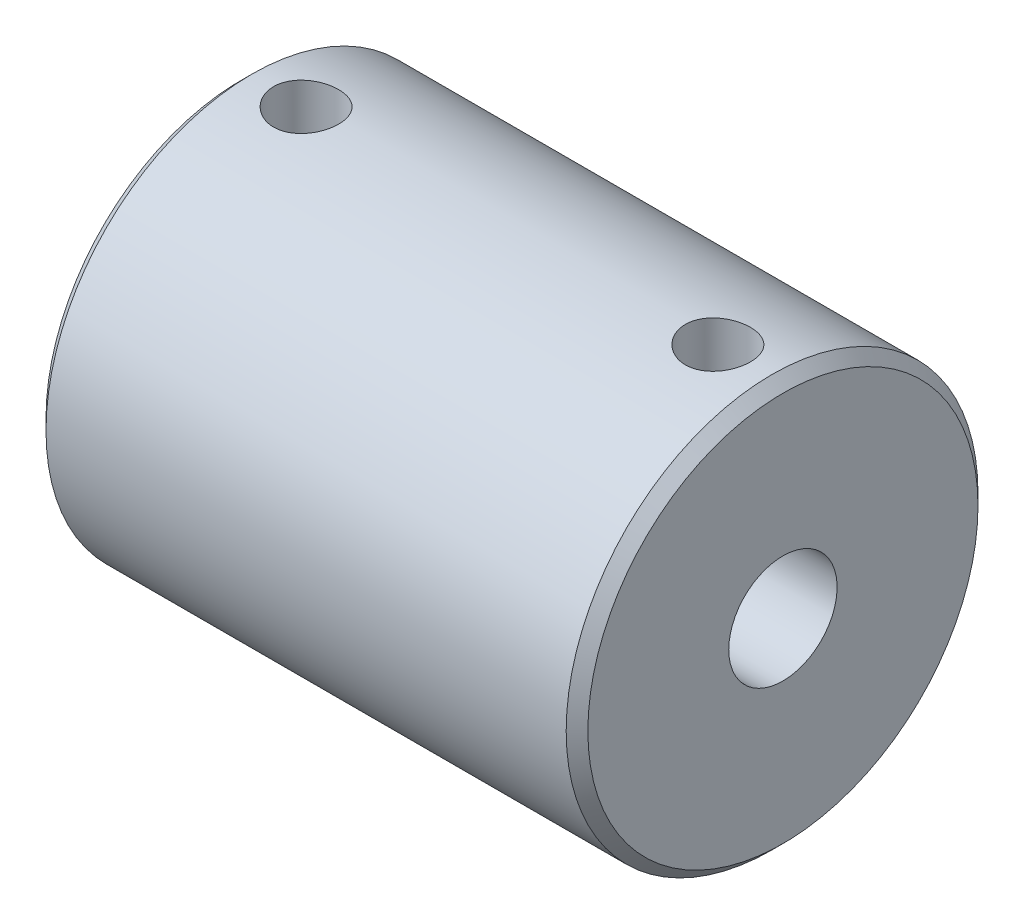
ISO-10303-21;
HEADER;
FILE_DESCRIPTION(('STEP AP214'),'2;1');
FILE_NAME('part.step','',(''),(''),'','','');
FILE_SCHEMA(('AUTOMOTIVE_DESIGN { 1 0 10303 214 1 1 1 1 }'));
ENDSEC;
DATA;
#1=APPLICATION_CONTEXT('core data for automotive mechanical design processes');
#2=APPLICATION_PROTOCOL_DEFINITION('international standard','automotive_design',2000,#1);
#3=PRODUCT_CONTEXT('',#1,'mechanical');
#4=PRODUCT('Part','Part','',(#3));
#5=PRODUCT_RELATED_PRODUCT_CATEGORY('part','',(#4));
#6=PRODUCT_DEFINITION_FORMATION('','',#4);
#7=PRODUCT_DEFINITION_CONTEXT('part definition',#1,'design');
#8=PRODUCT_DEFINITION('design','',#6,#7);
#9=PRODUCT_DEFINITION_SHAPE('','',#8);
#10=(LENGTH_UNIT() NAMED_UNIT(*) SI_UNIT(.MILLI.,.METRE.));
#11=(NAMED_UNIT(*) PLANE_ANGLE_UNIT() SI_UNIT($,.RADIAN.));
#12=(NAMED_UNIT(*) SI_UNIT($,.STERADIAN.) SOLID_ANGLE_UNIT());
#13=UNCERTAINTY_MEASURE_WITH_UNIT(LENGTH_MEASURE(1.E-05),#10,'distance_accuracy_value','');
#14=(GEOMETRIC_REPRESENTATION_CONTEXT(3) GLOBAL_UNCERTAINTY_ASSIGNED_CONTEXT((#13)) GLOBAL_UNIT_ASSIGNED_CONTEXT((#10,
#11,#12)) REPRESENTATION_CONTEXT('',''));
#15=CARTESIAN_POINT('',(0.,0.,0.));
#16=DIRECTION('',(0.,0.,1.));
#17=DIRECTION('',(1.,0.,0.));
#18=AXIS2_PLACEMENT_3D('',#15,#16,#17);
#19=CARTESIAN_POINT('',(-12.5000000000002,0.,0.));
#20=DIRECTION('',(-1.,0.,0.));
#21=DIRECTION('',(0.,0.,1.));
#22=AXIS2_PLACEMENT_3D('',#19,#20,#21);
#23=CYLINDRICAL_SURFACE('',#22,3.99999999999978);
#24=CARTESIAN_POINT('',(-4.44089209850063E-13,0.,0.));
#25=DIRECTION('',(-1.,0.,0.));
#26=DIRECTION('',(0.,0.,1.));
#27=AXIS2_PLACEMENT_3D('',#24,#25,#26);
#28=CIRCLE('',#27,3.99999999999978);
#29=CARTESIAN_POINT('',(-4.44089209850063E-13,0.,3.99999999999978));
#30=VERTEX_POINT('',#29);
#31=EDGE_CURVE('E52',#30,#30,#28,.T.);
#32=ORIENTED_EDGE('',*,*,#31,.F.);
#33=EDGE_LOOP('',(#32));
#34=FACE_BOUND('',#33,.T.);
#35=CARTESIAN_POINT('',(-12.5000000000002,0.,0.));
#36=DIRECTION('',(-1.,0.,0.));
#37=DIRECTION('',(0.,0.,1.));
#38=AXIS2_PLACEMENT_3D('',#35,#36,#37);
#39=CIRCLE('',#38,3.99999999999978);
#40=CARTESIAN_POINT('',(-12.5000000000002,0.,3.99999999999978));
#41=VERTEX_POINT('',#40);
#42=EDGE_CURVE('E61',#41,#41,#39,.T.);
#43=ORIENTED_EDGE('',*,*,#42,.T.);
#44=EDGE_LOOP('',(#43));
#45=FACE_BOUND('',#44,.T.);
#46=CARTESIAN_POINT('',(-9.50000000000073,3.70809924354753,-1.50000000000017));
#47=CARTESIAN_POINT('',(-9.58100748372152,3.70809640633776,-1.50000304106126));
#48=CARTESIAN_POINT('',(-9.66199492250437,3.71078260240956,-1.49341597549504));
#49=CARTESIAN_POINT('',(-9.82152808291394,3.72116159304937,-1.46736187895485));
#50=CARTESIAN_POINT('',(-9.90007387759575,3.72885423767082,-1.4478952337328));
#51=CARTESIAN_POINT('',(-10.0523753716143,3.74825480280871,-1.39689657610591));
#52=CARTESIAN_POINT('',(-10.1261420566518,3.75995309569231,-1.36539347266365));
#53=CARTESIAN_POINT('',(-10.2673718968196,3.7860313420657,-1.29131856742714));
#54=CARTESIAN_POINT('',(-10.3348331502833,3.80041210067295,-1.24874344095055));
#55=CARTESIAN_POINT('',(-10.4648903116236,3.83103574665685,-1.15146661374179));
#56=CARTESIAN_POINT('',(-10.5271285296301,3.84733341923576,-1.09630381213323));
#57=CARTESIAN_POINT('',(-10.6417228146722,3.8794975062852,-0.97639583977909));
#58=CARTESIAN_POINT('',(-10.6940767737426,3.89536382814759,-0.911648630256843));
#59=CARTESIAN_POINT('',(-10.7891395122964,3.92552873936528,-0.77169465517776));
#60=CARTESIAN_POINT('',(-10.8314594747166,3.9397556122348,-0.696206947538185));
#61=CARTESIAN_POINT('',(-10.9026511725257,3.96438007973823,-0.538555771965397));
#62=CARTESIAN_POINT('',(-10.9315275719928,3.97477900216983,-0.456394630933682));
#63=CARTESIAN_POINT('',(-10.9737578957754,3.99018697103417,-0.291489341676971));
#64=CARTESIAN_POINT('',(-10.9877276274412,3.99540915214752,-0.208923197281731));
#65=CARTESIAN_POINT('',(-11.0017212009458,4.00064014107918,-0.0424643637949135));
#66=CARTESIAN_POINT('',(-11.0017495776195,4.0006506441488,0.0414278850627095));
#67=CARTESIAN_POINT('',(-10.9882182385356,3.99559265903873,0.203743543064359));
#68=CARTESIAN_POINT('',(-10.975330702052,3.99077541996662,0.282232178266786));
#69=CARTESIAN_POINT('',(-10.9374640847752,3.97693274932242,0.435839217984282));
#70=CARTESIAN_POINT('',(-10.9124841477388,3.96790701975557,0.510957383430192));
#71=CARTESIAN_POINT('',(-10.8508295483249,3.9463776916751,0.656989017303002));
#72=CARTESIAN_POINT('',(-10.8139899947324,3.93382539470057,0.727825392287209));
#73=CARTESIAN_POINT('',(-10.7298079030714,3.90651310225259,0.862486607957464));
#74=CARTESIAN_POINT('',(-10.6824619769832,3.8917523951282,0.92630917693223));
#75=CARTESIAN_POINT('',(-10.5753727137176,3.86052529655796,1.04909048680085));
#76=CARTESIAN_POINT('',(-10.5150660843504,3.84400963763862,1.1075461452634));
#77=CARTESIAN_POINT('',(-10.3854070066792,3.81182460645702,1.21370395569334));
#78=CARTESIAN_POINT('',(-10.3160522934141,3.79615544748827,1.26140340692892));
#79=CARTESIAN_POINT('',(-10.168280532538,3.76712703500315,1.34565611808144));
#80=CARTESIAN_POINT('',(-10.0896965063147,3.75382677150256,1.38193847851824));
#81=CARTESIAN_POINT('',(-9.9269037748332,3.73172438628982,1.44056464441495));
#82=CARTESIAN_POINT('',(-9.84269822840708,3.72291976205762,1.46291620605589));
#83=CARTESIAN_POINT('',(-9.67602403768481,3.71139597222827,1.49190191709662));
#84=CARTESIAN_POINT('',(-9.59371589446462,3.70836785241516,1.4993352115896));
#85=CARTESIAN_POINT('',(-9.42899064325901,3.70786539524994,1.50057885636267));
#86=CARTESIAN_POINT('',(-9.34657356764828,3.71038967003965,1.49439261093757));
#87=CARTESIAN_POINT('',(-9.18807007771306,3.72039381629714,1.46929733520152));
#88=CARTESIAN_POINT('',(-9.11186886423608,3.72763276216427,1.4510061833422));
#89=CARTESIAN_POINT('',(-8.96365205528054,3.7459648704634,1.40299774640633));
#90=CARTESIAN_POINT('',(-8.8916373208326,3.75705882250151,1.37327812034618));
#91=CARTESIAN_POINT('',(-8.75083556192452,3.78236243116058,1.30200292275273));
#92=CARTESIAN_POINT('',(-8.68227070786338,3.79667328892044,1.26004545177042));
#93=CARTESIAN_POINT('',(-8.55287101827468,3.8266281429427,1.16591317862474));
#94=CARTESIAN_POINT('',(-8.49203902537608,3.84227262594056,1.1137346369643));
#95=CARTESIAN_POINT('',(-8.37583162680561,3.87433046553163,0.996727340900885));
#96=CARTESIAN_POINT('',(-8.32104659123195,3.89072969357006,0.931306341491007));
#97=CARTESIAN_POINT('',(-8.22316163241126,3.92149874963281,0.791797471753093));
#98=CARTESIAN_POINT('',(-8.18006174705485,3.93586857107643,0.717709573322613));
#99=CARTESIAN_POINT('',(-8.10705394380108,3.96094985704531,0.563016329468413));
#100=CARTESIAN_POINT('',(-8.07710087620808,3.97167381337989,0.48243443306456));
#101=CARTESIAN_POINT('',(-8.03134358615076,3.9882943671255,0.316881887523183));
#102=CARTESIAN_POINT('',(-8.01553271457828,3.99419323299391,0.231913320723519));
#103=CARTESIAN_POINT('',(-7.99922559724585,4.00028407317051,0.0653355852737363));
#104=CARTESIAN_POINT('',(-7.99789051694168,4.00078860953742,-0.0161807680609268));
#105=CARTESIAN_POINT('',(-8.00841515944606,3.99684889809201,-0.17822678641251));
#106=CARTESIAN_POINT('',(-8.02027329088653,3.99240524713108,-0.258756569245345));
#107=CARTESIAN_POINT('',(-8.05625885149429,3.97921089603748,-0.414548248377219));
#108=CARTESIAN_POINT('',(-8.08007990587902,3.97056791377994,-0.48989073106893));
#109=CARTESIAN_POINT('',(-8.13901001338502,3.94987783620966,-0.63551547300649));
#110=CARTESIAN_POINT('',(-8.17412120330541,3.9378300965564,-0.705796771275645));
#111=CARTESIAN_POINT('',(-8.25631394350547,3.9109061830005,-0.842540176994521));
#112=CARTESIAN_POINT('',(-8.30383664051481,3.89593240108803,-0.908717548846961));
#113=CARTESIAN_POINT('',(-8.40880783018826,3.86499507694818,-1.03241734752348));
#114=CARTESIAN_POINT('',(-8.46625986580854,3.84903118274001,-1.08993667125602));
#115=CARTESIAN_POINT('',(-8.59306413164572,3.81688129739148,-1.19781214236209));
#116=CARTESIAN_POINT('',(-8.66288440215497,3.80072805349132,-1.24762999816039));
#117=CARTESIAN_POINT('',(-8.81041586957399,3.7709832500361,-1.33484709556857));
#118=CARTESIAN_POINT('',(-8.88812788405415,3.75739195631188,-1.37224504878171));
#119=CARTESIAN_POINT('',(-9.05295568097609,3.73402269853237,-1.43465886974276));
#120=CARTESIAN_POINT('',(-9.14033436651247,3.7244380329083,-1.45906002899539));
#121=CARTESIAN_POINT('',(-9.3184852719565,3.71147994336285,-1.49172356722096));
#122=CARTESIAN_POINT('',(-9.40925521271071,3.70810242179706,-1.49999659339587));
#123=CARTESIAN_POINT('',(-9.50000000000073,3.70809924354753,-1.50000000000017));
#124=B_SPLINE_CURVE_WITH_KNOTS('',3,(#46,#47,#48,#49,#50,#51,#52,#53,#54,#55,#56,#57,#58,#59,
#60,#61,#62,#63,#64,#65,#66,#67,#68,#69,#70,#71,#72,#73,#74,#75,#76,#77,#78,#79,#80,#81,#82,#83,
#84,#85,#86,#87,#88,#89,#90,#91,#92,#93,#94,#95,#96,#97,#98,#99,#100,#101,#102,#103,#104,#105,
#106,#107,#108,#109,#110,#111,#112,#113,#114,#115,#116,#117,#118,#119,#120,#121,#122,#123),
.UNSPECIFIED.,.T.,.F.,(4,2,2,2,2,2,2,2,2,2,2,2,2,2,2,2,2,2,2,2,2,2,2,2,2,2,2,2,2,2,2,2,2,2,2,2,
2,2,4),(0.,0.242684541416176,0.485361814598865,0.727459856757045,0.969630679682955,
1.22274652401131,1.47591628822987,1.73770072136426,1.99939426381337,2.24980018489687,
2.50012465404866,2.73806472803204,2.97602165263346,3.21744131210679,3.45893893628987,
3.71456675065887,3.97025867827348,4.23162592252981,4.49284751635489,4.73965657740501,
4.98640395388902,5.22143845928217,5.45652113429545,5.70041561005841,5.94439948466376,
6.20385016993646,6.463301696502,6.72185508890192,6.98028685560151,7.22365720549961,
7.46699820319505,7.70440274003917,7.94185223512858,8.18928323677015,8.43680270894993,
8.69738599542109,8.95799630544274,9.23003178870961,9.50188762323091),.UNSPECIFIED.);
#125=CARTESIAN_POINT('',(-9.50000000000073,3.70809924354753,-1.50000000000017));
#126=VERTEX_POINT('',#125);
#127=EDGE_CURVE('E98',#126,#126,#124,.T.);
#128=ORIENTED_EDGE('',*,*,#127,.T.);
#129=EDGE_LOOP('',(#128));
#130=FACE_BOUND('',#129,.T.);
#131=ADVANCED_FACE('F32',(#34,#45,#130),#23,.F.);
#132=CARTESIAN_POINT('',(-12.5000000000002,0.,0.));
#133=DIRECTION('',(-1.,0.,0.));
#134=DIRECTION('',(0.,0.,1.));
#135=AXIS2_PLACEMENT_3D('',#132,#133,#134);
#136=CYLINDRICAL_SURFACE('',#135,2.49999999999984);
#137=CARTESIAN_POINT('',(12.4999999999997,0.,0.));
#138=DIRECTION('',(-1.,0.,0.));
#139=DIRECTION('',(0.,0.,1.));
#140=AXIS2_PLACEMENT_3D('',#137,#138,#139);
#141=CIRCLE('',#140,2.49999999999984);
#142=CARTESIAN_POINT('',(12.4999999999997,0.,2.49999999999984));
#143=VERTEX_POINT('',#142);
#144=EDGE_CURVE('E58',#143,#143,#141,.T.);
#145=ORIENTED_EDGE('',*,*,#144,.F.);
#146=EDGE_LOOP('',(#145));
#147=FACE_BOUND('',#146,.T.);
#148=CARTESIAN_POINT('',(-4.44089209850063E-13,0.,0.));
#149=DIRECTION('',(-1.,0.,0.));
#150=DIRECTION('',(0.,0.,1.));
#151=AXIS2_PLACEMENT_3D('',#148,#149,#150);
#152=CIRCLE('',#151,2.49999999999984);
#153=CARTESIAN_POINT('',(-4.44089209850063E-13,0.,2.49999999999984));
#154=VERTEX_POINT('',#153);
#155=EDGE_CURVE('E55',#154,#154,#152,.T.);
#156=ORIENTED_EDGE('',*,*,#155,.T.);
#157=EDGE_LOOP('',(#156));
#158=FACE_BOUND('',#157,.T.);
#159=CARTESIAN_POINT('',(9.49999999999918,1.99999999999984,-1.49999999999995));
#160=CARTESIAN_POINT('',(9.42452102470954,1.99999416642495,-1.50000404108586));
#161=CARTESIAN_POINT('',(9.34906156591938,2.00433633903465,-1.49426852824008));
#162=CARTESIAN_POINT('',(9.20067609603695,2.02092590613866,-1.47174965152782));
#163=CARTESIAN_POINT('',(9.12775281261407,2.03318155043081,-1.4549547578893));
#164=CARTESIAN_POINT('',(8.98691635832188,2.06362339034714,-1.4114348633579));
#165=CARTESIAN_POINT('',(8.91897116196389,2.08176666183104,-1.38478154503144));
#166=CARTESIAN_POINT('',(8.78856254663123,2.1218590499582,-1.32252909283013));
#167=CARTESIAN_POINT('',(8.72610077030401,2.143809301224,-1.28692729054687));
#168=CARTESIAN_POINT('',(8.60005098333506,2.19228594587527,-1.20271292747638));
#169=CARTESIAN_POINT('',(8.5372590428752,2.21904371037647,-1.15304179435282));
#170=CARTESIAN_POINT('',(8.42023523725739,2.27226229431046,-1.04426801309978));
#171=CARTESIAN_POINT('',(8.36600984832834,2.29872287517088,-0.985158296729543));
#172=CARTESIAN_POINT('',(8.26186619028944,2.35175567858719,-0.851442367411626));
#173=CARTESIAN_POINT('',(8.21304553632938,2.37803133577803,-0.77585199516247));
#174=CARTESIAN_POINT('',(8.12919027755469,2.42443786983164,-0.615654228271574));
#175=CARTESIAN_POINT('',(8.09414302587641,2.4445743798872,-0.531055196626242));
#176=CARTESIAN_POINT('',(8.04240407718647,2.47470987800425,-0.363771406742572));
#177=CARTESIAN_POINT('',(8.02427963903182,2.48549303939154,-0.281674698130819));
#178=CARTESIAN_POINT('',(8.002057197136,2.49874939277529,-0.11497050938261));
#179=CARTESIAN_POINT('',(7.99794602199907,2.50123038813291,-0.0303654624000535));
#180=CARTESIAN_POINT('',(8.00361374734158,2.49783372711522,0.127637283737411));
#181=CARTESIAN_POINT('',(8.01173352616843,2.49295437513709,0.201123832865737));
#182=CARTESIAN_POINT('',(8.03847979564722,2.47707997553839,0.34546426915187));
#183=CARTESIAN_POINT('',(8.05710706390627,2.4660844752929,0.416317961051304));
#184=CARTESIAN_POINT('',(8.10416556270289,2.438849072017,0.554056780469183));
#185=CARTESIAN_POINT('',(8.13265306113811,2.42257910450804,0.620916491037723));
#186=CARTESIAN_POINT('',(8.19838461622465,2.38609637638728,0.748988660115719));
#187=CARTESIAN_POINT('',(8.23563094705812,2.36588259201791,0.810199646208119));
#188=CARTESIAN_POINT('',(8.32283909280356,2.3203792597634,0.933074267143312));
#189=CARTESIAN_POINT('',(8.37378831173484,2.29477182952127,0.993918663198309));
#190=CARTESIAN_POINT('',(8.48440411785928,2.24255554245577,1.10671465909287));
#191=CARTESIAN_POINT('',(8.54408250347361,2.2159453670335,1.15865401308352));
#192=CARTESIAN_POINT('',(8.67865340616266,2.16111075123919,1.2582483776743));
#193=CARTESIAN_POINT('',(8.75450757653857,2.13305661385097,1.30470933188646));
#194=CARTESIAN_POINT('',(8.91470623163572,2.08250879557238,1.38397217194247));
#195=CARTESIAN_POINT('',(8.99903471612476,2.0600049029879,1.41679921962204));
#196=CARTESIAN_POINT('',(9.15239363189447,2.028958651967,1.46077497064858));
#197=CARTESIAN_POINT('',(9.22004063229576,2.01833888618284,1.47527903312681));
#198=CARTESIAN_POINT('',(9.35737361029859,2.00392150777525,1.494808727553));
#199=CARTESIAN_POINT('',(9.42705712048367,2.00011596115083,1.49984538302923));
#200=CARTESIAN_POINT('',(9.5665516824348,1.9998891432129,1.500147811142));
#201=CARTESIAN_POINT('',(9.6363627772143,2.00347810223951,1.49540004697676));
#202=CARTESIAN_POINT('',(9.77398734374765,2.01751520788618,1.4764029057496));
#203=CARTESIAN_POINT('',(9.84179919223934,2.02796877613179,1.46214601830158));
#204=CARTESIAN_POINT('',(9.97371457947887,2.05431768333066,1.42488312618677));
#205=CARTESIAN_POINT('',(10.0378226365313,2.07020622092778,1.40188805257383));
#206=CARTESIAN_POINT('',(10.1614777157293,2.10571539417553,1.34796261057095));
#207=CARTESIAN_POINT('',(10.2210230063651,2.12533743689965,1.31702924888235));
#208=CARTESIAN_POINT('',(10.3452400825113,2.17036819177703,1.24167439558537));
#209=CARTESIAN_POINT('',(10.4089008350956,2.19618239397336,1.19582663060328));
#210=CARTESIAN_POINT('',(10.5282854848485,2.24821754803589,1.09487395518728));
#211=CARTESIAN_POINT('',(10.5840016921682,2.27443886711424,1.03976018672431));
#212=CARTESIAN_POINT('',(10.6932240073495,2.32835625910884,0.913274837213068));
#213=CARTESIAN_POINT('',(10.745500726605,2.35580075875842,0.840721108780496));
#214=CARTESIAN_POINT('',(10.8369027768358,2.40537639133433,0.686103100868329));
#215=CARTESIAN_POINT('',(10.8760368278401,2.42751104449386,0.604045176135012));
#216=CARTESIAN_POINT('',(10.9368682034305,2.46252280092753,0.438840232972443));
#217=CARTESIAN_POINT('',(10.9596262277903,2.47595588067308,0.356205963651558));
#218=CARTESIAN_POINT('',(10.9907146028455,2.49440738906081,0.187383063891142));
#219=CARTESIAN_POINT('',(10.9990612907168,2.4994353458272,0.101198571782245));
#220=CARTESIAN_POINT('',(11.0006746085852,2.5004060046196,-0.0598120232007227));
#221=CARTESIAN_POINT('',(10.9958033345623,2.49747057186312,-0.13462058358945));
#222=CARTESIAN_POINT('',(10.9751061756176,2.48512948412082,-0.28214875597853));
#223=CARTESIAN_POINT('',(10.9592801686777,2.47572375706626,-0.354868344701677));
#224=CARTESIAN_POINT('',(10.9177804284155,2.4514942752695,-0.495145481978568));
#225=CARTESIAN_POINT('',(10.89226840387,2.43675966858895,-0.562767032608604));
#226=CARTESIAN_POINT('',(10.8323594054445,2.40303337447144,-0.692781971999765));
#227=CARTESIAN_POINT('',(10.7979604391397,2.38404073252258,-0.755174184199616));
#228=CARTESIAN_POINT('',(10.7170748034306,2.34093432659371,-0.880263645295737));
#229=CARTESIAN_POINT('',(10.6696812909825,2.3164884463914,-0.942258690439733));
#230=CARTESIAN_POINT('',(10.5662469662816,2.26601907350652,-1.05789751536287));
#231=CARTESIAN_POINT('',(10.5101965743914,2.239993852745,-1.11153190956896));
#232=CARTESIAN_POINT('',(10.3827144378217,2.18528165666196,-1.21590975350552));
#233=CARTESIAN_POINT('',(10.3102335138339,2.15667566270892,-1.26542406663351));
#234=CARTESIAN_POINT('',(10.1565151472328,2.10376464485135,-1.3515681721031));
#235=CARTESIAN_POINT('',(10.075282286018,2.07945738811042,-1.38820466322647));
#236=CARTESIAN_POINT('',(9.91293571486216,2.04080003047947,-1.44437116535122));
#237=CARTESIAN_POINT('',(9.83240476403808,2.02577665830124,-1.46509526060179));
#238=CARTESIAN_POINT('',(9.66790260529558,2.0053903232002,-1.4928926824042));
#239=CARTESIAN_POINT('',(9.5839392342405,2.00000648744627,-1.49999550595831));
#240=CARTESIAN_POINT('',(9.49999999999918,1.99999999999984,-1.49999999999995));
#241=B_SPLINE_CURVE_WITH_KNOTS('',3,(#159,#160,#161,#162,#163,#164,#165,#166,#167,#168,#169,
#170,#171,#172,#173,#174,#175,#176,#177,#178,#179,#180,#181,#182,#183,#184,#185,#186,#187,#188,
#189,#190,#191,#192,#193,#194,#195,#196,#197,#198,#199,#200,#201,#202,#203,#204,#205,#206,#207,
#208,#209,#210,#211,#212,#213,#214,#215,#216,#217,#218,#219,#220,#221,#222,#223,#224,#225,#226,
#227,#228,#229,#230,#231,#232,#233,#234,#235,#236,#237,#238,#239,#240),.UNSPECIFIED.,.T.,.F.,(4,
2,2,2,2,2,2,2,2,2,2,2,2,2,2,2,2,2,2,2,2,2,2,2,2,2,2,2,2,2,2,2,2,2,2,2,2,2,2,2,4),(0.,
0.226085249493399,0.452406574330785,0.677113624991901,0.901887762215962,1.15414462390005,
1.40659128601849,1.68630157736229,1.96575443271227,2.21853330858505,2.47107452602774,
2.6923013054319,2.91354445887953,3.13607155036385,3.35865648368887,3.60782810055859,
3.8573396665692,4.1357667114029,4.41367760154784,4.62276298054698,4.8316047564399,
5.04073566011194,5.2500319330414,5.45906724365506,5.6681814915467,5.91499438482011,
6.16204457978462,6.44121828011599,6.7202063838486,6.97891479383353,7.23732973022745,
7.46129321849419,7.68525920139669,7.90563970188777,8.12606965394605,8.37042963549506,
8.61506198741973,8.89071695766622,9.16622832484824,9.41820120134384,9.6696278091232),.UNSPECIFIED.);
#242=CARTESIAN_POINT('',(9.49999999999918,1.99999999999984,-1.49999999999995));
#243=VERTEX_POINT('',#242);
#244=EDGE_CURVE('E65',#243,#243,#241,.T.);
#245=ORIENTED_EDGE('',*,*,#244,.T.);
#246=EDGE_LOOP('',(#245));
#247=FACE_BOUND('',#246,.T.);
#248=ADVANCED_FACE('F115',(#147,#158,#247),#136,.F.);
#249=CARTESIAN_POINT('',(-12.5000000000002,0.,0.));
#250=DIRECTION('',(-1.,0.,0.));
#251=DIRECTION('',(0.,0.,1.));
#252=AXIS2_PLACEMENT_3D('',#249,#250,#251);
#253=CYLINDRICAL_SURFACE('',#252,9.49999999999984);
#254=CARTESIAN_POINT('',(-12.0000000000002,0.,0.));
#255=DIRECTION('',(1.,0.,0.));
#256=DIRECTION('',(0.,0.,-1.));
#257=AXIS2_PLACEMENT_3D('',#254,#255,#256);
#258=CIRCLE('',#257,9.49999999999984);
#259=CARTESIAN_POINT('',(-12.0000000000002,0.,-9.49999999999984));
#260=VERTEX_POINT('',#259);
#261=EDGE_CURVE('E39',#260,#260,#258,.T.);
#262=ORIENTED_EDGE('',*,*,#261,.T.);
#263=EDGE_LOOP('',(#262));
#264=FACE_BOUND('',#263,.T.);
#265=CARTESIAN_POINT('',(11.9999999999997,0.,0.));
#266=DIRECTION('',(1.,0.,0.));
#267=DIRECTION('',(0.,0.,-1.));
#268=AXIS2_PLACEMENT_3D('',#265,#266,#267);
#269=CIRCLE('',#268,9.49999999999984);
#270=CARTESIAN_POINT('',(11.9999999999997,0.,-9.49999999999984));
#271=VERTEX_POINT('',#270);
#272=EDGE_CURVE('E43',#271,#271,#269,.F.);
#273=ORIENTED_EDGE('',*,*,#272,.T.);
#274=EDGE_LOOP('',(#273));
#275=FACE_BOUND('',#274,.T.);
#276=CARTESIAN_POINT('',(9.49999999999918,9.38083151964671,-1.49999999999995));
#277=CARTESIAN_POINT('',(9.41630973099314,9.38083297404052,-1.4999965845505));
#278=CARTESIAN_POINT('',(9.3325722057596,9.38196360092013,-1.49297223784078));
#279=CARTESIAN_POINT('',(9.16744219630623,9.38636039550326,-1.46507009131932));
#280=CARTESIAN_POINT('',(9.08605201876941,9.38962859377928,-1.44417911871306));
#281=CARTESIAN_POINT('',(8.92803062681439,9.39792135372617,-1.38918760267273));
#282=CARTESIAN_POINT('',(8.85139566713777,9.40294451195268,-1.3550976121646));
#283=CARTESIAN_POINT('',(8.70494308976362,9.41417954535185,-1.27470128030852));
#284=CARTESIAN_POINT('',(8.63512461427251,9.42039127066202,-1.22839647880726));
#285=CARTESIAN_POINT('',(8.5036587559119,9.4333650383851,-1.1244471383638));
#286=CARTESIAN_POINT('',(8.44208051568565,9.44013105201456,-1.06671563821391));
#287=CARTESIAN_POINT('',(8.32944292542648,9.45341567106024,-0.941739545888648));
#288=CARTESIAN_POINT('',(8.27838417422193,9.45993426237456,-0.874494412511199));
#289=CARTESIAN_POINT('',(8.18797774403456,9.47203134599654,-0.731954548292079));
#290=CARTESIAN_POINT('',(8.14869405700653,9.47760463238802,-0.656618750818272));
#291=CARTESIAN_POINT('',(8.08336383437381,9.48713906529752,-0.500315336961878));
#292=CARTESIAN_POINT('',(8.05731652523227,9.49110030602114,-0.419348049999248));
#293=CARTESIAN_POINT('',(8.01940893218588,9.4969362980598,-0.254793214503829));
#294=CARTESIAN_POINT('',(8.00743267318298,9.49882809687214,-0.171232996932396));
#295=CARTESIAN_POINT('',(7.9976467905339,9.50037054461914,-0.00326909893878029));
#296=CARTESIAN_POINT('',(7.99983629844012,9.50002133094149,0.0811345294604442));
#297=CARTESIAN_POINT('',(8.01822877181978,9.49713466336602,0.247597304848761));
#298=CARTESIAN_POINT('',(8.0343069477585,9.4946166962783,0.329670625894022));
#299=CARTESIAN_POINT('',(8.07982419166969,9.48769715323501,0.489939598315428));
#300=CARTESIAN_POINT('',(8.1092636331835,9.48329552461806,0.568135141212597));
#301=CARTESIAN_POINT('',(8.18079375615204,9.47306987014868,0.718803540216258));
#302=CARTESIAN_POINT('',(8.22293645712464,9.4672400144859,0.791251288178998));
#303=CARTESIAN_POINT('',(8.31863878352587,9.4548067115046,0.92809384959411));
#304=CARTESIAN_POINT('',(8.3721992402151,9.44820320787701,0.992488076174384));
#305=CARTESIAN_POINT('',(8.48991047611315,9.43487320037029,1.11213206749245));
#306=CARTESIAN_POINT('',(8.55417026276891,9.42814614020964,1.1672745780543));
#307=CARTESIAN_POINT('',(8.69108712416624,9.41539709463324,1.26601092962915));
#308=CARTESIAN_POINT('',(8.76374426178539,9.40937511449767,1.30960468415951));
#309=CARTESIAN_POINT('',(8.91551094643623,9.39871800561204,1.38402357522732));
#310=CARTESIAN_POINT('',(8.99462642215803,9.39408416980411,1.41483681797806));
#311=CARTESIAN_POINT('',(9.15699942058984,9.38675017598379,1.4627074978431));
#312=CARTESIAN_POINT('',(9.24025661752225,9.3840498661414,1.47976601505963));
#313=CARTESIAN_POINT('',(9.40759295565802,9.38091773533541,1.4994941104296));
#314=CARTESIAN_POINT('',(9.49165369121741,9.38046188392356,1.5023161208022));
#315=CARTESIAN_POINT('',(9.65904705893222,9.38180638869053,1.49389636898127));
#316=CARTESIAN_POINT('',(9.74237971611599,9.38360666700312,1.48265509215656));
#317=CARTESIAN_POINT('',(9.90547366936188,9.3892384519747,1.44655746438424));
#318=CARTESIAN_POINT('',(9.98525237171265,9.3930585117587,1.42177781446749));
#319=CARTESIAN_POINT('',(10.1395243407153,9.40228991972521,1.35938693205207));
#320=CARTESIAN_POINT('',(10.2140173203886,9.40770135422655,1.32177500349146));
#321=CARTESIAN_POINT('',(10.3562843153162,9.41956203589055,1.23442398163641));
#322=CARTESIAN_POINT('',(10.4239973256046,9.42601953670201,1.1845866710986));
#323=CARTESIAN_POINT('',(10.5501534885918,9.43922022959424,1.07433532022979));
#324=CARTESIAN_POINT('',(10.6085960580292,9.44596343961696,1.0139206149114));
#325=CARTESIAN_POINT('',(10.7151040379325,9.45905128553875,0.883556250112928));
#326=CARTESIAN_POINT('',(10.7630681337625,9.46539164279532,0.813523322568075));
#327=CARTESIAN_POINT('',(10.8465500312286,9.47689193046165,0.666305394879959));
#328=CARTESIAN_POINT('',(10.8820682027036,9.48205189594596,0.589120607345147));
#329=CARTESIAN_POINT('',(10.9394900801753,9.4905913350519,0.430099180755925));
#330=CARTESIAN_POINT('',(10.9614480818947,9.49397790107181,0.348282544696238));
#331=CARTESIAN_POINT('',(10.9913016379697,9.49861883842432,0.182065541000644));
#332=CARTESIAN_POINT('',(10.9991982260063,9.49987336648676,0.0976653637497523));
#333=CARTESIAN_POINT('',(11.0006774861186,9.50010700904766,-0.0703424890560549));
#334=CARTESIAN_POINT('',(10.9944147738008,9.49911070212576,-0.153948809855574));
#335=CARTESIAN_POINT('',(10.9680860098252,9.49500446266288,-0.318903288593668));
#336=CARTESIAN_POINT('',(10.9480200169141,9.49189453911744,-0.400251456141409));
#337=CARTESIAN_POINT('',(10.89471123864,9.48390902705514,-0.558330315524323));
#338=CARTESIAN_POINT('',(10.8614802910497,9.47903502511613,-0.635065084473709));
#339=CARTESIAN_POINT('',(10.7828017130734,9.46805518209944,-0.781893871437035));
#340=CARTESIAN_POINT('',(10.7373536008617,9.46194929244043,-0.851987627392393));
#341=CARTESIAN_POINT('',(10.6349767236377,9.44910438099909,-0.9843264992901));
#342=CARTESIAN_POINT('',(10.5779342156674,9.44235947063336,-1.04648306132945));
#343=CARTESIAN_POINT('',(10.4542269669346,9.42903896923972,-1.16039729972457));
#344=CARTESIAN_POINT('',(10.3875599742262,9.42246341826417,-1.21215253557005));
#345=CARTESIAN_POINT('',(10.2460015685173,9.41018172735945,-1.30409009743281));
#346=CARTESIAN_POINT('',(10.1710611506852,9.40448130469067,-1.34419772972852));
#347=CARTESIAN_POINT('',(10.0154502477475,9.39466254048789,-1.41119529560829));
#348=CARTESIAN_POINT('',(9.93478570374219,9.39054258623323,-1.43809871074198));
#349=CARTESIAN_POINT('',(9.79481712821035,9.38528558640026,-1.47193913254661));
#350=CARTESIAN_POINT('',(9.73637003401492,9.38362436450199,-1.48244550005062));
#351=CARTESIAN_POINT('',(9.61862319936572,9.3813968239922,-1.49647709113166));
#352=CARTESIAN_POINT('',(9.55932347191092,9.38083048870618,-1.50000242102597));
#353=CARTESIAN_POINT('',(9.49999999999918,9.38083151964671,-1.49999999999995));
#354=B_SPLINE_CURVE_WITH_KNOTS('',3,(#276,#277,#278,#279,#280,#281,#282,#283,#284,#285,#286,
#287,#288,#289,#290,#291,#292,#293,#294,#295,#296,#297,#298,#299,#300,#301,#302,#303,#304,#305,
#306,#307,#308,#309,#310,#311,#312,#313,#314,#315,#316,#317,#318,#319,#320,#321,#322,#323,#324,
#325,#326,#327,#328,#329,#330,#331,#332,#333,#334,#335,#336,#337,#338,#339,#340,#341,#342,#343,
#344,#345,#346,#347,#348,#349,#350,#351,#352,#353),.UNSPECIFIED.,.T.,.F.,(4,2,2,2,2,2,2,2,2,2,2,
2,2,2,2,2,2,2,2,2,2,2,2,2,2,2,2,2,2,2,2,2,2,2,2,2,2,2,4),(0.,0.250853927262175,
0.501946498416287,0.752838728320986,1.00369934487585,1.25654807889775,1.50941120251435,
1.76362459165423,2.01782312279836,2.26991148848847,2.52198439977637,2.77181572176534,
3.0216540287272,3.27252964579784,3.52342353390945,3.77705047333321,4.03067931198419,
4.28454365571385,4.53838806257528,4.78950866646269,5.04062060361771,5.29032441173739,
5.54004176670749,5.79183509438441,6.04364425767629,6.29778980620844,6.55192780199674,
6.80504150202896,7.05813659442548,7.30848132386876,7.55882498785151,7.80894405482711,
8.05907298755242,8.31178569360939,8.5645576257437,8.81891644248674,9.07301501496329,
9.25083440456639,9.42865108605914),.UNSPECIFIED.);
#355=CARTESIAN_POINT('',(9.49999999999918,9.38083151964671,-1.49999999999995));
#356=VERTEX_POINT('',#355);
#357=EDGE_CURVE('E73',#356,#356,#354,.T.);
#358=ORIENTED_EDGE('',*,*,#357,.F.);
#359=EDGE_LOOP('',(#358));
#360=FACE_BOUND('',#359,.T.);
#361=CARTESIAN_POINT('',(-9.50000000000073,9.38083151964667,-1.50000000000017));
#362=CARTESIAN_POINT('',(-9.58369026900677,9.38083297404048,-1.49999658455072));
#363=CARTESIAN_POINT('',(-9.66742779424031,9.38196360092009,-1.49297223784101));
#364=CARTESIAN_POINT('',(-9.83255780369367,9.38636039550322,-1.46507009131955));
#365=CARTESIAN_POINT('',(-9.9139479812305,9.38962859377924,-1.44417911871328));
#366=CARTESIAN_POINT('',(-10.0719693731855,9.39792135372613,-1.38918760267296));
#367=CARTESIAN_POINT('',(-10.1486043328621,9.40294451195265,-1.35509761216482));
#368=CARTESIAN_POINT('',(-10.2950569102363,9.41417954535182,-1.27470128030875));
#369=CARTESIAN_POINT('',(-10.3648753857274,9.42039127066199,-1.22839647880749));
#370=CARTESIAN_POINT('',(-10.496341244088,9.43336503838507,-1.12444713836402));
#371=CARTESIAN_POINT('',(-10.5579194843143,9.44013105201454,-1.06671563821413));
#372=CARTESIAN_POINT('',(-10.6705570745734,9.45341567106022,-0.941739545888871));
#373=CARTESIAN_POINT('',(-10.721615825778,9.45993426237454,-0.874494412511424));
#374=CARTESIAN_POINT('',(-10.8120222559653,9.47203134599652,-0.731954548292304));
#375=CARTESIAN_POINT('',(-10.8513059429934,9.47760463238801,-0.656618750818497));
#376=CARTESIAN_POINT('',(-10.9166361656261,9.48713906529751,-0.500315336962104));
#377=CARTESIAN_POINT('',(-10.9426834747676,9.49110030602113,-0.419348049999474));
#378=CARTESIAN_POINT('',(-10.980591067814,9.49693629805979,-0.254793214504055));
#379=CARTESIAN_POINT('',(-10.9925673268169,9.49882809687214,-0.171232996932621));
#380=CARTESIAN_POINT('',(-11.002353209466,9.50037054461914,-0.00326909893900456));
#381=CARTESIAN_POINT('',(-11.0001637015598,9.50002133094149,0.0811345294602203));
#382=CARTESIAN_POINT('',(-10.9817712281801,9.49713466336603,0.247597304848537));
#383=CARTESIAN_POINT('',(-10.9656930522414,9.49461669627831,0.329670625893799));
#384=CARTESIAN_POINT('',(-10.9201758083302,9.48769715323503,0.489939598315205));
#385=CARTESIAN_POINT('',(-10.8907363668164,9.48329552461808,0.568135141212374));
#386=CARTESIAN_POINT('',(-10.8192062438479,9.47306987014869,0.718803540216035));
#387=CARTESIAN_POINT('',(-10.7770635428753,9.46724001448592,0.791251288178775));
#388=CARTESIAN_POINT('',(-10.681361216474,9.45480671150462,0.928093849593887));
#389=CARTESIAN_POINT('',(-10.6278007597848,9.44820320787704,0.99248807617416));
#390=CARTESIAN_POINT('',(-10.5100895238868,9.43487320037031,1.11213206749223));
#391=CARTESIAN_POINT('',(-10.445829737231,9.42814614020967,1.16727457805407));
#392=CARTESIAN_POINT('',(-10.3089128758337,9.41539709463327,1.26601092962893));
#393=CARTESIAN_POINT('',(-10.2362557382145,9.4093751144977,1.30960468415929));
#394=CARTESIAN_POINT('',(-10.0844890535637,9.39871800561207,1.3840235752271));
#395=CARTESIAN_POINT('',(-10.0053735778419,9.39408416980415,1.41483681797784));
#396=CARTESIAN_POINT('',(-9.84300057941006,9.38675017598383,1.46270749784288));
#397=CARTESIAN_POINT('',(-9.75974338247766,9.38404986614144,1.4797660150594));
#398=CARTESIAN_POINT('',(-9.59240704434189,9.38091773533544,1.49949411042937));
#399=CARTESIAN_POINT('',(-9.5083463087825,9.3804618839236,1.50231612080197));
#400=CARTESIAN_POINT('',(-9.34095294106769,9.38180638869056,1.49389636898105));
#401=CARTESIAN_POINT('',(-9.25762028388392,9.38360666700316,1.48265509215634));
#402=CARTESIAN_POINT('',(-9.09452633063802,9.38923845197473,1.44655746438402));
#403=CARTESIAN_POINT('',(-9.01474762828725,9.39305851175873,1.42177781446726));
#404=CARTESIAN_POINT('',(-8.86047565928459,9.40228991972524,1.35938693205185));
#405=CARTESIAN_POINT('',(-8.78598267961127,9.40770135422658,1.32177500349124));
#406=CARTESIAN_POINT('',(-8.64371568468374,9.41956203589058,1.23442398163619));
#407=CARTESIAN_POINT('',(-8.57600267439533,9.42601953670204,1.18458667109838));
#408=CARTESIAN_POINT('',(-8.44984651140811,9.43922022959426,1.07433532022956));
#409=CARTESIAN_POINT('',(-8.39140394197072,9.44596343961698,1.01392061491118));
#410=CARTESIAN_POINT('',(-8.28489596206737,9.45905128553877,0.883556250112706));
#411=CARTESIAN_POINT('',(-8.23693186623745,9.46539164279534,0.813523322567852));
#412=CARTESIAN_POINT('',(-8.15344996877133,9.47689193046167,0.666305394879736));
#413=CARTESIAN_POINT('',(-8.11793179729626,9.48205189594598,0.589120607344924));
#414=CARTESIAN_POINT('',(-8.06050991982466,9.49059133505191,0.430099180755702));
#415=CARTESIAN_POINT('',(-8.03855191810521,9.49397790107182,0.348282544696016));
#416=CARTESIAN_POINT('',(-8.00869836203024,9.49861883842433,0.182065541000421));
#417=CARTESIAN_POINT('',(-8.00080177399357,9.49987336648676,0.0976653637495302));
#418=CARTESIAN_POINT('',(-7.99932251388133,9.50010700904766,-0.0703424890562767));
#419=CARTESIAN_POINT('',(-8.00558522619908,9.49911070212576,-0.153948809855796));
#420=CARTESIAN_POINT('',(-8.03191399017468,9.49500446266287,-0.318903288593889));
#421=CARTESIAN_POINT('',(-8.05197998308576,9.49189453911743,-0.40025145614163));
#422=CARTESIAN_POINT('',(-8.10528876135992,9.48390902705513,-0.558330315524544));
#423=CARTESIAN_POINT('',(-8.13851970895023,9.47903502511611,-0.635065084473931));
#424=CARTESIAN_POINT('',(-8.21719828692651,9.46805518209942,-0.781893871437256));
#425=CARTESIAN_POINT('',(-8.26264639913822,9.46194929244041,-0.851987627392615));
#426=CARTESIAN_POINT('',(-8.36502327636219,9.44910438099907,-0.984326499290322));
#427=CARTESIAN_POINT('',(-8.4220657843325,9.44235947063334,-1.04648306132967));
#428=CARTESIAN_POINT('',(-8.54577303306532,9.42903896923969,-1.1603972997248));
#429=CARTESIAN_POINT('',(-8.61244002577369,9.42246341826414,-1.21215253557027));
#430=CARTESIAN_POINT('',(-8.75399843148256,9.41018172735941,-1.30409009743303));
#431=CARTESIAN_POINT('',(-8.82893884931472,9.40448130469064,-1.34419772972874));
#432=CARTESIAN_POINT('',(-8.98454975225242,9.39466254048786,-1.41119529560851));
#433=CARTESIAN_POINT('',(-9.06521429625771,9.39054258623319,-1.43809871074221));
#434=CARTESIAN_POINT('',(-9.20518287178956,9.38528558640023,-1.47193913254683));
#435=CARTESIAN_POINT('',(-9.26362996598499,9.38362436450196,-1.48244550005084));
#436=CARTESIAN_POINT('',(-9.38137680063419,9.38139682399217,-1.49647709113188));
#437=CARTESIAN_POINT('',(-9.44067652808898,9.38083048870614,-1.50000242102619));
#438=CARTESIAN_POINT('',(-9.50000000000073,9.38083151964667,-1.50000000000017));
#439=B_SPLINE_CURVE_WITH_KNOTS('',3,(#361,#362,#363,#364,#365,#366,#367,#368,#369,#370,#371,
#372,#373,#374,#375,#376,#377,#378,#379,#380,#381,#382,#383,#384,#385,#386,#387,#388,#389,#390,
#391,#392,#393,#394,#395,#396,#397,#398,#399,#400,#401,#402,#403,#404,#405,#406,#407,#408,#409,
#410,#411,#412,#413,#414,#415,#416,#417,#418,#419,#420,#421,#422,#423,#424,#425,#426,#427,#428,
#429,#430,#431,#432,#433,#434,#435,#436,#437,#438),.UNSPECIFIED.,.T.,.F.,(4,2,2,2,2,2,2,2,2,2,2,
2,2,2,2,2,2,2,2,2,2,2,2,2,2,2,2,2,2,2,2,2,2,2,2,2,2,2,4),(0.,0.250853927262175,
0.501946498416286,0.752838728320986,1.00369934487585,1.25654807889775,1.50941120251435,
1.76362459165423,2.01782312279836,2.26991148848846,2.52198439977637,2.77181572176534,
3.0216540287272,3.27252964579784,3.52342353390945,3.77705047333321,4.03067931198419,
4.28454365571385,4.53838806257527,4.78950866646269,5.04062060361771,5.29032441173739,
5.54004176670749,5.79183509438441,6.04364425767629,6.29778980620845,6.55192780199674,
6.80504150202896,7.05813659442548,7.30848132386876,7.55882498785151,7.80894405482711,
8.05907298755242,8.31178569360939,8.5645576257437,8.81891644248674,9.07301501496329,
9.25083440456639,9.42865108605914),.UNSPECIFIED.);
#440=CARTESIAN_POINT('',(-9.50000000000073,9.38083151964667,-1.50000000000017));
#441=VERTEX_POINT('',#440);
#442=EDGE_CURVE('E64',#441,#441,#439,.T.);
#443=ORIENTED_EDGE('',*,*,#442,.F.);
#444=EDGE_LOOP('',(#443));
#445=FACE_BOUND('',#444,.T.);
#446=ADVANCED_FACE('F111',(#264,#275,#360,#445),#253,.T.);
#447=CARTESIAN_POINT('',(-4.44089209850063E-13,0.,0.));
#448=DIRECTION('',(1.,0.,0.));
#449=DIRECTION('',(0.,0.,-1.));
#450=AXIS2_PLACEMENT_3D('',#447,#448,#449);
#451=PLANE('',#450);
#452=ORIENTED_EDGE('',*,*,#155,.F.);
#453=EDGE_LOOP('',(#452));
#454=FACE_BOUND('',#453,.T.);
#455=ORIENTED_EDGE('',*,*,#31,.T.);
#456=EDGE_LOOP('',(#455));
#457=FACE_BOUND('',#456,.T.);
#458=ADVANCED_FACE('F114',(#454,#457),#451,.F.);
#459=CARTESIAN_POINT('',(12.4999999999997,0.,0.));
#460=DIRECTION('',(1.,0.,0.));
#461=DIRECTION('',(0.,0.,-1.));
#462=AXIS2_PLACEMENT_3D('',#459,#460,#461);
#463=PLANE('',#462);
#464=CARTESIAN_POINT('',(12.4999999999997,0.,0.));
#465=DIRECTION('',(1.,0.,0.));
#466=DIRECTION('',(0.,0.,-1.));
#467=AXIS2_PLACEMENT_3D('',#464,#465,#466);
#468=CIRCLE('',#467,8.99999999999984);
#469=CARTESIAN_POINT('',(12.4999999999997,0.,-8.99999999999984));
#470=VERTEX_POINT('',#469);
#471=EDGE_CURVE('E10',#470,#470,#468,.T.);
#472=ORIENTED_EDGE('',*,*,#471,.T.);
#473=EDGE_LOOP('',(#472));
#474=FACE_BOUND('',#473,.T.);
#475=ORIENTED_EDGE('',*,*,#144,.T.);
#476=EDGE_LOOP('',(#475));
#477=FACE_BOUND('',#476,.T.);
#478=ADVANCED_FACE('F123',(#474,#477),#463,.T.);
#479=CARTESIAN_POINT('',(-12.5000000000002,0.,0.));
#480=DIRECTION('',(1.,0.,0.));
#481=DIRECTION('',(0.,0.,-1.));
#482=AXIS2_PLACEMENT_3D('',#479,#480,#481);
#483=PLANE('',#482);
#484=CARTESIAN_POINT('',(-12.5000000000002,0.,0.));
#485=DIRECTION('',(1.,0.,0.));
#486=DIRECTION('',(0.,0.,-1.));
#487=AXIS2_PLACEMENT_3D('',#484,#485,#486);
#488=CIRCLE('',#487,8.99999999999983);
#489=CARTESIAN_POINT('',(-12.5000000000002,0.,-8.99999999999983));
#490=VERTEX_POINT('',#489);
#491=EDGE_CURVE('E47',#490,#490,#488,.F.);
#492=ORIENTED_EDGE('',*,*,#491,.T.);
#493=EDGE_LOOP('',(#492));
#494=FACE_BOUND('',#493,.T.);
#495=ORIENTED_EDGE('',*,*,#42,.F.);
#496=EDGE_LOOP('',(#495));
#497=FACE_BOUND('',#496,.T.);
#498=ADVANCED_FACE('F146',(#494,#497),#483,.F.);
#499=CARTESIAN_POINT('',(9.49999999999918,9.50099999999984,1.11022302462516E-13));
#500=DIRECTION('',(0.,-1.,0.));
#501=DIRECTION('',(0.,0.,-1.));
#502=AXIS2_PLACEMENT_3D('',#499,#500,#501);
#503=CYLINDRICAL_SURFACE('',#502,1.50000000000006);
#504=ORIENTED_EDGE('',*,*,#357,.T.);
#505=EDGE_LOOP('',(#504));
#506=FACE_BOUND('',#505,.T.);
#507=ORIENTED_EDGE('',*,*,#244,.F.);
#508=EDGE_LOOP('',(#507));
#509=FACE_BOUND('',#508,.T.);
#510=ADVANCED_FACE('F79',(#506,#509),#503,.F.);
#511=CARTESIAN_POINT('',(-9.50000000000073,9.50099999999984,-1.11022302462516E-13));
#512=DIRECTION('',(0.,-1.,0.));
#513=DIRECTION('',(0.,0.,-1.));
#514=AXIS2_PLACEMENT_3D('',#511,#512,#513);
#515=CYLINDRICAL_SURFACE('',#514,1.50000000000006);
#516=ORIENTED_EDGE('',*,*,#442,.T.);
#517=EDGE_LOOP('',(#516));
#518=FACE_BOUND('',#517,.T.);
#519=ORIENTED_EDGE('',*,*,#127,.F.);
#520=EDGE_LOOP('',(#519));
#521=FACE_BOUND('',#520,.T.);
#522=ADVANCED_FACE('F85',(#518,#521),#515,.F.);
#523=CARTESIAN_POINT('',(-12.5000000000002,0.,0.));
#524=DIRECTION('',(1.,0.,0.));
#525=DIRECTION('',(0.,0.,-1.));
#526=AXIS2_PLACEMENT_3D('',#523,#524,#525);
#527=CONICAL_SURFACE('',#526,8.99999999999983,0.785398163397447);
#528=ORIENTED_EDGE('',*,*,#261,.F.);
#529=EDGE_LOOP('',(#528));
#530=FACE_BOUND('',#529,.T.);
#531=ORIENTED_EDGE('',*,*,#491,.F.);
#532=EDGE_LOOP('',(#531));
#533=FACE_BOUND('',#532,.T.);
#534=ADVANCED_FACE('F89',(#530,#533),#527,.T.);
#535=CARTESIAN_POINT('',(11.9999999999997,0.,0.));
#536=DIRECTION('',(-1.,0.,0.));
#537=DIRECTION('',(0.,0.,1.));
#538=AXIS2_PLACEMENT_3D('',#535,#536,#537);
#539=CONICAL_SURFACE('',#538,9.49999999999984,0.785398163397445);
#540=ORIENTED_EDGE('',*,*,#471,.F.);
#541=EDGE_LOOP('',(#540));
#542=FACE_BOUND('',#541,.T.);
#543=ORIENTED_EDGE('',*,*,#272,.F.);
#544=EDGE_LOOP('',(#543));
#545=FACE_BOUND('',#544,.T.);
#546=ADVANCED_FACE('F34',(#542,#545),#539,.T.);
#547=CLOSED_SHELL('',(#131,#248,#446,#458,#478,#498,#510,#522,#534,#546));
#548=MANIFOLD_SOLID_BREP('B2',#547);
#549=ADVANCED_BREP_SHAPE_REPRESENTATION('',(#18,#548),#14);
#550=SHAPE_DEFINITION_REPRESENTATION(#9,#549);
ENDSEC;
END-ISO-10303-21;
